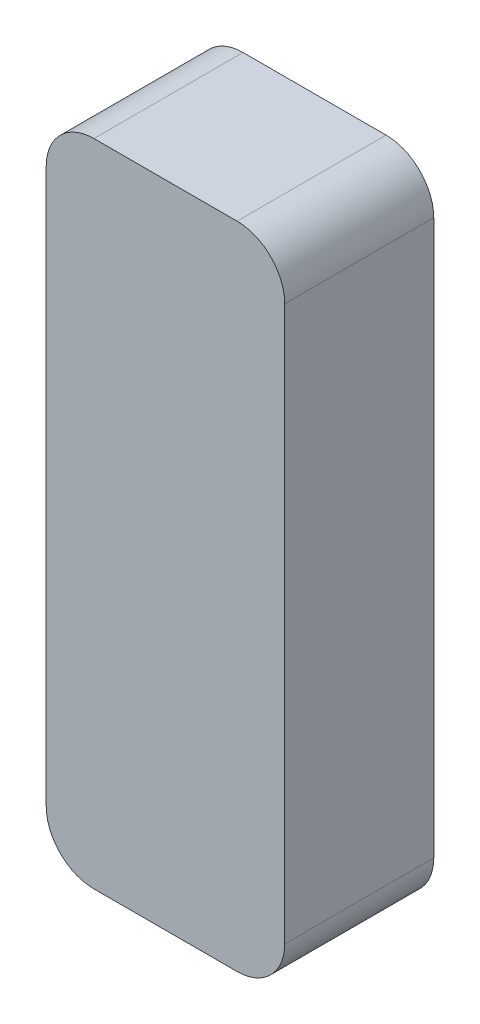
ISO-10303-21;
HEADER;
FILE_DESCRIPTION(('STEP AP214'),'2;1');
FILE_NAME('part.step','',(''),(''),'','','');
FILE_SCHEMA(('AUTOMOTIVE_DESIGN { 1 0 10303 214 1 1 1 1 }'));
ENDSEC;
DATA;
#1=APPLICATION_CONTEXT('core data for automotive mechanical design processes');
#2=APPLICATION_PROTOCOL_DEFINITION('international standard','automotive_design',2000,#1);
#3=PRODUCT_CONTEXT('',#1,'mechanical');
#4=PRODUCT('Part','Part','',(#3));
#5=PRODUCT_RELATED_PRODUCT_CATEGORY('part','',(#4));
#6=PRODUCT_DEFINITION_FORMATION('','',#4);
#7=PRODUCT_DEFINITION_CONTEXT('part definition',#1,'design');
#8=PRODUCT_DEFINITION('design','',#6,#7);
#9=PRODUCT_DEFINITION_SHAPE('','',#8);
#10=(LENGTH_UNIT() NAMED_UNIT(*) SI_UNIT(.MILLI.,.METRE.));
#11=(NAMED_UNIT(*) PLANE_ANGLE_UNIT() SI_UNIT($,.RADIAN.));
#12=(NAMED_UNIT(*) SI_UNIT($,.STERADIAN.) SOLID_ANGLE_UNIT());
#13=UNCERTAINTY_MEASURE_WITH_UNIT(LENGTH_MEASURE(1.E-05),#10,'distance_accuracy_value','');
#14=(GEOMETRIC_REPRESENTATION_CONTEXT(3) GLOBAL_UNCERTAINTY_ASSIGNED_CONTEXT((#13)) GLOBAL_UNIT_ASSIGNED_CONTEXT((#10,
#11,#12)) REPRESENTATION_CONTEXT('',''));
#15=CARTESIAN_POINT('',(0.,0.,0.));
#16=DIRECTION('',(0.,0.,1.));
#17=DIRECTION('',(1.,0.,0.));
#18=AXIS2_PLACEMENT_3D('',#15,#16,#17);
#19=CARTESIAN_POINT('',(20.,54.5,25.));
#20=DIRECTION('',(-1.,0.,0.));
#21=DIRECTION('',(0.,-1.,0.));
#22=AXIS2_PLACEMENT_3D('',#19,#20,#21);
#23=PLANE('',#22);
#24=DIRECTION('',(0.,1.,0.));
#25=VECTOR('',#24,1.);
#26=CARTESIAN_POINT('',(20.,54.5,25.));
#27=LINE('',#26,#25);
#28=CARTESIAN_POINT('',(20.,-46.5,25.));
#29=VERTEX_POINT('',#28);
#30=CARTESIAN_POINT('',(20.,46.5,25.));
#31=VERTEX_POINT('',#30);
#32=EDGE_CURVE('E128',#29,#31,#27,.T.);
#33=ORIENTED_EDGE('',*,*,#32,.F.);
#34=DIRECTION('',(0.,0.,-1.));
#35=VECTOR('',#34,1.);
#36=CARTESIAN_POINT('',(20.,-46.5,25.));
#37=LINE('',#36,#35);
#38=CARTESIAN_POINT('',(20.,-46.5,0.));
#39=VERTEX_POINT('',#38);
#40=EDGE_CURVE('E154',#29,#39,#37,.T.);
#41=ORIENTED_EDGE('',*,*,#40,.T.);
#42=DIRECTION('',(0.,1.,0.));
#43=VECTOR('',#42,1.);
#44=CARTESIAN_POINT('',(20.,54.5,0.));
#45=LINE('',#44,#43);
#46=CARTESIAN_POINT('',(20.,46.5,0.));
#47=VERTEX_POINT('',#46);
#48=EDGE_CURVE('E162',#39,#47,#45,.T.);
#49=ORIENTED_EDGE('',*,*,#48,.T.);
#50=DIRECTION('',(0.,0.,-1.));
#51=VECTOR('',#50,1.);
#52=CARTESIAN_POINT('',(20.,46.5,25.));
#53=LINE('',#52,#51);
#54=EDGE_CURVE('E152',#47,#31,#53,.F.);
#55=ORIENTED_EDGE('',*,*,#54,.T.);
#56=EDGE_LOOP('',(#33,#41,#49,#55));
#57=FACE_BOUND('',#56,.T.);
#58=ADVANCED_FACE('F37',(#57),#23,.F.);
#59=CARTESIAN_POINT('',(-20.,54.5,25.));
#60=DIRECTION('',(0.,-1.,0.));
#61=DIRECTION('',(0.,0.,-1.));
#62=AXIS2_PLACEMENT_3D('',#59,#60,#61);
#63=PLANE('',#62);
#64=DIRECTION('',(-1.,0.,0.));
#65=VECTOR('',#64,1.);
#66=CARTESIAN_POINT('',(-20.,54.5,0.));
#67=LINE('',#66,#65);
#68=CARTESIAN_POINT('',(12.,54.5,0.));
#69=VERTEX_POINT('',#68);
#70=CARTESIAN_POINT('',(-12.,54.5,0.));
#71=VERTEX_POINT('',#70);
#72=EDGE_CURVE('E133',#69,#71,#67,.T.);
#73=ORIENTED_EDGE('',*,*,#72,.T.);
#74=DIRECTION('',(0.,0.,-1.));
#75=VECTOR('',#74,1.);
#76=CARTESIAN_POINT('',(-12.,54.5,25.));
#77=LINE('',#76,#75);
#78=CARTESIAN_POINT('',(-12.,54.5,25.));
#79=VERTEX_POINT('',#78);
#80=EDGE_CURVE('E11',#71,#79,#77,.F.);
#81=ORIENTED_EDGE('',*,*,#80,.T.);
#82=DIRECTION('',(-1.,0.,0.));
#83=VECTOR('',#82,1.);
#84=CARTESIAN_POINT('',(-20.,54.5,25.));
#85=LINE('',#84,#83);
#86=CARTESIAN_POINT('',(12.,54.5,25.));
#87=VERTEX_POINT('',#86);
#88=EDGE_CURVE('E131',#87,#79,#85,.T.);
#89=ORIENTED_EDGE('',*,*,#88,.F.);
#90=DIRECTION('',(0.,0.,-1.));
#91=VECTOR('',#90,1.);
#92=CARTESIAN_POINT('',(12.,54.5,25.));
#93=LINE('',#92,#91);
#94=EDGE_CURVE('E45',#87,#69,#93,.T.);
#95=ORIENTED_EDGE('',*,*,#94,.T.);
#96=EDGE_LOOP('',(#73,#81,#89,#95));
#97=FACE_BOUND('',#96,.T.);
#98=ADVANCED_FACE('F159',(#97),#63,.F.);
#99=CARTESIAN_POINT('',(-20.,54.5,25.));
#100=DIRECTION('',(1.,0.,0.));
#101=DIRECTION('',(0.,1.,0.));
#102=AXIS2_PLACEMENT_3D('',#99,#100,#101);
#103=PLANE('',#102);
#104=DIRECTION('',(0.,-1.,0.));
#105=VECTOR('',#104,1.);
#106=CARTESIAN_POINT('',(-20.,54.5,0.));
#107=LINE('',#106,#105);
#108=CARTESIAN_POINT('',(-20.,46.5,0.));
#109=VERTEX_POINT('',#108);
#110=CARTESIAN_POINT('',(-20.,-46.5,0.));
#111=VERTEX_POINT('',#110);
#112=EDGE_CURVE('E129',#109,#111,#107,.T.);
#113=ORIENTED_EDGE('',*,*,#112,.T.);
#114=DIRECTION('',(0.,0.,-1.));
#115=VECTOR('',#114,1.);
#116=CARTESIAN_POINT('',(-20.,-46.5,25.));
#117=LINE('',#116,#115);
#118=CARTESIAN_POINT('',(-20.,-46.5,25.));
#119=VERTEX_POINT('',#118);
#120=EDGE_CURVE('E107',#111,#119,#117,.F.);
#121=ORIENTED_EDGE('',*,*,#120,.T.);
#122=DIRECTION('',(0.,-1.,0.));
#123=VECTOR('',#122,1.);
#124=CARTESIAN_POINT('',(-20.,54.5,25.));
#125=LINE('',#124,#123);
#126=CARTESIAN_POINT('',(-20.,46.5,25.));
#127=VERTEX_POINT('',#126);
#128=EDGE_CURVE('E166',#127,#119,#125,.T.);
#129=ORIENTED_EDGE('',*,*,#128,.F.);
#130=DIRECTION('',(0.,0.,-1.));
#131=VECTOR('',#130,1.);
#132=CARTESIAN_POINT('',(-20.,46.5,25.));
#133=LINE('',#132,#131);
#134=EDGE_CURVE('E112',#127,#109,#133,.T.);
#135=ORIENTED_EDGE('',*,*,#134,.T.);
#136=EDGE_LOOP('',(#113,#121,#129,#135));
#137=FACE_BOUND('',#136,.T.);
#138=ADVANCED_FACE('F176',(#137),#103,.F.);
#139=CARTESIAN_POINT('',(-20.,-54.5,25.));
#140=DIRECTION('',(0.,1.,0.));
#141=DIRECTION('',(0.,0.,1.));
#142=AXIS2_PLACEMENT_3D('',#139,#140,#141);
#143=PLANE('',#142);
#144=DIRECTION('',(1.,0.,0.));
#145=VECTOR('',#144,1.);
#146=CARTESIAN_POINT('',(-20.,-54.5,25.));
#147=LINE('',#146,#145);
#148=CARTESIAN_POINT('',(-12.,-54.5,25.));
#149=VERTEX_POINT('',#148);
#150=CARTESIAN_POINT('',(12.,-54.5,25.));
#151=VERTEX_POINT('',#150);
#152=EDGE_CURVE('E122',#149,#151,#147,.T.);
#153=ORIENTED_EDGE('',*,*,#152,.F.);
#154=DIRECTION('',(0.,0.,-1.));
#155=VECTOR('',#154,1.);
#156=CARTESIAN_POINT('',(-12.,-54.5,25.));
#157=LINE('',#156,#155);
#158=CARTESIAN_POINT('',(-12.,-54.5,0.));
#159=VERTEX_POINT('',#158);
#160=EDGE_CURVE('E106',#149,#159,#157,.T.);
#161=ORIENTED_EDGE('',*,*,#160,.T.);
#162=DIRECTION('',(1.,0.,0.));
#163=VECTOR('',#162,1.);
#164=CARTESIAN_POINT('',(-20.,-54.5,0.));
#165=LINE('',#164,#163);
#166=CARTESIAN_POINT('',(12.,-54.5,0.));
#167=VERTEX_POINT('',#166);
#168=EDGE_CURVE('E119',#159,#167,#165,.T.);
#169=ORIENTED_EDGE('',*,*,#168,.T.);
#170=DIRECTION('',(0.,0.,-1.));
#171=VECTOR('',#170,1.);
#172=CARTESIAN_POINT('',(12.,-54.5,25.));
#173=LINE('',#172,#171);
#174=EDGE_CURVE('E124',#167,#151,#173,.F.);
#175=ORIENTED_EDGE('',*,*,#174,.T.);
#176=EDGE_LOOP('',(#153,#161,#169,#175));
#177=FACE_BOUND('',#176,.T.);
#178=ADVANCED_FACE('F118',(#177),#143,.F.);
#179=CARTESIAN_POINT('',(0.,0.,25.));
#180=DIRECTION('',(0.,0.,1.));
#181=DIRECTION('',(1.,0.,0.));
#182=AXIS2_PLACEMENT_3D('',#179,#180,#181);
#183=PLANE('',#182);
#184=ORIENTED_EDGE('',*,*,#128,.T.);
#185=CARTESIAN_POINT('',(-12.,-46.5,25.));
#186=DIRECTION('',(0.,0.,1.));
#187=DIRECTION('',(1.,0.,0.));
#188=AXIS2_PLACEMENT_3D('',#185,#186,#187);
#189=CIRCLE('',#188,8.);
#190=EDGE_CURVE('E150',#119,#149,#189,.T.);
#191=ORIENTED_EDGE('',*,*,#190,.T.);
#192=ORIENTED_EDGE('',*,*,#152,.T.);
#193=CARTESIAN_POINT('',(12.,-46.5,25.));
#194=DIRECTION('',(0.,0.,1.));
#195=DIRECTION('',(1.,0.,0.));
#196=AXIS2_PLACEMENT_3D('',#193,#194,#195);
#197=CIRCLE('',#196,8.);
#198=EDGE_CURVE('E148',#151,#29,#197,.T.);
#199=ORIENTED_EDGE('',*,*,#198,.T.);
#200=ORIENTED_EDGE('',*,*,#32,.T.);
#201=CARTESIAN_POINT('',(12.,46.5,25.));
#202=DIRECTION('',(0.,0.,1.));
#203=DIRECTION('',(1.,0.,0.));
#204=AXIS2_PLACEMENT_3D('',#201,#202,#203);
#205=CIRCLE('',#204,8.);
#206=EDGE_CURVE('E57',#31,#87,#205,.T.);
#207=ORIENTED_EDGE('',*,*,#206,.T.);
#208=ORIENTED_EDGE('',*,*,#88,.T.);
#209=CARTESIAN_POINT('',(-12.,46.5,25.));
#210=DIRECTION('',(0.,0.,1.));
#211=DIRECTION('',(1.,0.,0.));
#212=AXIS2_PLACEMENT_3D('',#209,#210,#211);
#213=CIRCLE('',#212,8.);
#214=EDGE_CURVE('E146',#79,#127,#213,.T.);
#215=ORIENTED_EDGE('',*,*,#214,.T.);
#216=EDGE_LOOP('',(#184,#191,#192,#199,#200,#207,#208,#215));
#217=FACE_BOUND('',#216,.T.);
#218=ADVANCED_FACE('F170',(#217),#183,.T.);
#219=CARTESIAN_POINT('',(0.,0.,0.));
#220=DIRECTION('',(0.,0.,1.));
#221=DIRECTION('',(1.,0.,0.));
#222=AXIS2_PLACEMENT_3D('',#219,#220,#221);
#223=PLANE('',#222);
#224=ORIENTED_EDGE('',*,*,#168,.F.);
#225=CARTESIAN_POINT('',(-12.,-46.5,0.));
#226=DIRECTION('',(0.,0.,1.));
#227=DIRECTION('',(1.,0.,0.));
#228=AXIS2_PLACEMENT_3D('',#225,#226,#227);
#229=CIRCLE('',#228,8.);
#230=EDGE_CURVE('E102',#159,#111,#229,.F.);
#231=ORIENTED_EDGE('',*,*,#230,.T.);
#232=ORIENTED_EDGE('',*,*,#112,.F.);
#233=CARTESIAN_POINT('',(-12.,46.5,0.));
#234=DIRECTION('',(0.,0.,1.));
#235=DIRECTION('',(1.,0.,0.));
#236=AXIS2_PLACEMENT_3D('',#233,#234,#235);
#237=CIRCLE('',#236,8.);
#238=EDGE_CURVE('E139',#109,#71,#237,.F.);
#239=ORIENTED_EDGE('',*,*,#238,.T.);
#240=ORIENTED_EDGE('',*,*,#72,.F.);
#241=CARTESIAN_POINT('',(12.,46.5,0.));
#242=DIRECTION('',(0.,0.,1.));
#243=DIRECTION('',(1.,0.,0.));
#244=AXIS2_PLACEMENT_3D('',#241,#242,#243);
#245=CIRCLE('',#244,8.);
#246=EDGE_CURVE('E123',#69,#47,#245,.F.);
#247=ORIENTED_EDGE('',*,*,#246,.T.);
#248=ORIENTED_EDGE('',*,*,#48,.F.);
#249=CARTESIAN_POINT('',(12.,-46.5,0.));
#250=DIRECTION('',(0.,0.,1.));
#251=DIRECTION('',(1.,0.,0.));
#252=AXIS2_PLACEMENT_3D('',#249,#250,#251);
#253=CIRCLE('',#252,8.);
#254=EDGE_CURVE('E113',#39,#167,#253,.F.);
#255=ORIENTED_EDGE('',*,*,#254,.T.);
#256=EDGE_LOOP('',(#224,#231,#232,#239,#240,#247,#248,#255));
#257=FACE_BOUND('',#256,.T.);
#258=ADVANCED_FACE('F126',(#257),#223,.F.);
#259=CARTESIAN_POINT('',(-12.,-46.5,25.));
#260=DIRECTION('',(0.,0.,-1.));
#261=DIRECTION('',(-1.,0.,0.));
#262=AXIS2_PLACEMENT_3D('',#259,#260,#261);
#263=CYLINDRICAL_SURFACE('',#262,8.);
#264=ORIENTED_EDGE('',*,*,#190,.F.);
#265=ORIENTED_EDGE('',*,*,#120,.F.);
#266=ORIENTED_EDGE('',*,*,#230,.F.);
#267=ORIENTED_EDGE('',*,*,#160,.F.);
#268=EDGE_LOOP('',(#264,#265,#266,#267));
#269=FACE_BOUND('',#268,.T.);
#270=ADVANCED_FACE('F105',(#269),#263,.T.);
#271=CARTESIAN_POINT('',(12.,-46.5,25.));
#272=DIRECTION('',(0.,0.,-1.));
#273=DIRECTION('',(-1.,0.,0.));
#274=AXIS2_PLACEMENT_3D('',#271,#272,#273);
#275=CYLINDRICAL_SURFACE('',#274,8.);
#276=ORIENTED_EDGE('',*,*,#198,.F.);
#277=ORIENTED_EDGE('',*,*,#174,.F.);
#278=ORIENTED_EDGE('',*,*,#254,.F.);
#279=ORIENTED_EDGE('',*,*,#40,.F.);
#280=EDGE_LOOP('',(#276,#277,#278,#279));
#281=FACE_BOUND('',#280,.T.);
#282=ADVANCED_FACE('F181',(#281),#275,.T.);
#283=CARTESIAN_POINT('',(-12.,46.5,25.));
#284=DIRECTION('',(0.,0.,-1.));
#285=DIRECTION('',(-1.,0.,0.));
#286=AXIS2_PLACEMENT_3D('',#283,#284,#285);
#287=CYLINDRICAL_SURFACE('',#286,8.);
#288=ORIENTED_EDGE('',*,*,#214,.F.);
#289=ORIENTED_EDGE('',*,*,#80,.F.);
#290=ORIENTED_EDGE('',*,*,#238,.F.);
#291=ORIENTED_EDGE('',*,*,#134,.F.);
#292=EDGE_LOOP('',(#288,#289,#290,#291));
#293=FACE_BOUND('',#292,.T.);
#294=ADVANCED_FACE('F174',(#293),#287,.T.);
#295=CARTESIAN_POINT('',(12.,46.5,25.));
#296=DIRECTION('',(0.,0.,-1.));
#297=DIRECTION('',(-1.,0.,0.));
#298=AXIS2_PLACEMENT_3D('',#295,#296,#297);
#299=CYLINDRICAL_SURFACE('',#298,8.);
#300=ORIENTED_EDGE('',*,*,#206,.F.);
#301=ORIENTED_EDGE('',*,*,#54,.F.);
#302=ORIENTED_EDGE('',*,*,#246,.F.);
#303=ORIENTED_EDGE('',*,*,#94,.F.);
#304=EDGE_LOOP('',(#300,#301,#302,#303));
#305=FACE_BOUND('',#304,.T.);
#306=ADVANCED_FACE('F39',(#305),#299,.T.);
#307=CLOSED_SHELL('',(#58,#98,#138,#178,#218,#258,#270,#282,#294,#306));
#308=MANIFOLD_SOLID_BREP('B2',#307);
#309=ADVANCED_BREP_SHAPE_REPRESENTATION('',(#18,#308),#14);
#310=SHAPE_DEFINITION_REPRESENTATION(#9,#309);
ENDSEC;
END-ISO-10303-21;
